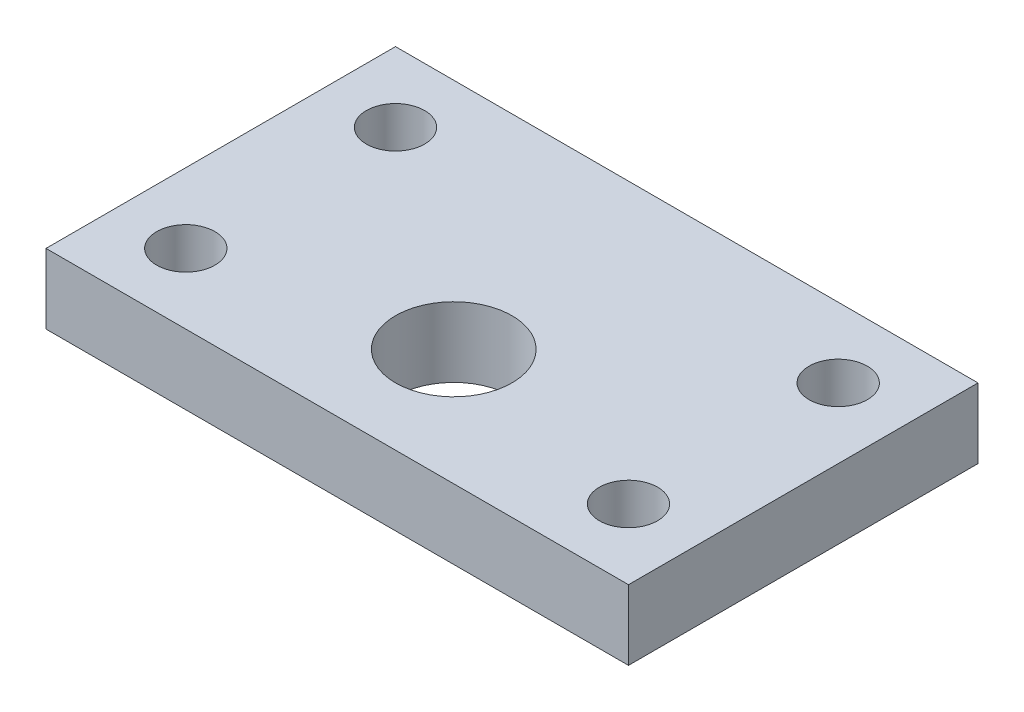
ISO-10303-21;
HEADER;
FILE_DESCRIPTION(('STEP AP214'),'2;1');
FILE_NAME('part.step','',(''),(''),'','','');
FILE_SCHEMA(('AUTOMOTIVE_DESIGN { 1 0 10303 214 1 1 1 1 }'));
ENDSEC;
DATA;
#1=APPLICATION_CONTEXT('core data for automotive mechanical design processes');
#2=APPLICATION_PROTOCOL_DEFINITION('international standard','automotive_design',2000,#1);
#3=PRODUCT_CONTEXT('',#1,'mechanical');
#4=PRODUCT('Part','Part','',(#3));
#5=PRODUCT_RELATED_PRODUCT_CATEGORY('part','',(#4));
#6=PRODUCT_DEFINITION_FORMATION('','',#4);
#7=PRODUCT_DEFINITION_CONTEXT('part definition',#1,'design');
#8=PRODUCT_DEFINITION('design','',#6,#7);
#9=PRODUCT_DEFINITION_SHAPE('','',#8);
#10=(LENGTH_UNIT() NAMED_UNIT(*) SI_UNIT(.MILLI.,.METRE.));
#11=(NAMED_UNIT(*) PLANE_ANGLE_UNIT() SI_UNIT($,.RADIAN.));
#12=(NAMED_UNIT(*) SI_UNIT($,.STERADIAN.) SOLID_ANGLE_UNIT());
#13=UNCERTAINTY_MEASURE_WITH_UNIT(LENGTH_MEASURE(1.E-05),#10,'distance_accuracy_value','');
#14=(GEOMETRIC_REPRESENTATION_CONTEXT(3) GLOBAL_UNCERTAINTY_ASSIGNED_CONTEXT((#13)) GLOBAL_UNIT_ASSIGNED_CONTEXT((#10,
#11,#12)) REPRESENTATION_CONTEXT('',''));
#15=CARTESIAN_POINT('',(0.,0.,0.));
#16=DIRECTION('',(0.,0.,1.));
#17=DIRECTION('',(1.,0.,0.));
#18=AXIS2_PLACEMENT_3D('',#15,#16,#17);
#19=CARTESIAN_POINT('',(0.,30.,0.));
#20=DIRECTION('',(0.,-1.,0.));
#21=DIRECTION('',(0.,0.,-1.));
#22=AXIS2_PLACEMENT_3D('',#19,#20,#21);
#23=PLANE('',#22);
#24=DIRECTION('',(0.,0.,1.));
#25=VECTOR('',#24,1.);
#26=CARTESIAN_POINT('',(0.,30.,0.));
#27=LINE('',#26,#25);
#28=CARTESIAN_POINT('',(0.,30.,-150.));
#29=VERTEX_POINT('',#28);
#30=CARTESIAN_POINT('',(0.,30.,0.));
#31=VERTEX_POINT('',#30);
#32=EDGE_CURVE('E89',#29,#31,#27,.T.);
#33=ORIENTED_EDGE('',*,*,#32,.T.);
#34=DIRECTION('',(1.,0.,0.));
#35=VECTOR('',#34,1.);
#36=CARTESIAN_POINT('',(0.,30.,0.));
#37=LINE('',#36,#35);
#38=CARTESIAN_POINT('',(250.,30.,0.));
#39=VERTEX_POINT('',#38);
#40=EDGE_CURVE('E84',#31,#39,#37,.T.);
#41=ORIENTED_EDGE('',*,*,#40,.T.);
#42=DIRECTION('',(0.,0.,-1.));
#43=VECTOR('',#42,1.);
#44=CARTESIAN_POINT('',(250.,30.,0.));
#45=LINE('',#44,#43);
#46=CARTESIAN_POINT('',(250.,30.,-150.));
#47=VERTEX_POINT('',#46);
#48=EDGE_CURVE('E87',#39,#47,#45,.T.);
#49=ORIENTED_EDGE('',*,*,#48,.T.);
#50=DIRECTION('',(-1.,0.,0.));
#51=VECTOR('',#50,1.);
#52=CARTESIAN_POINT('',(0.,30.,-150.));
#53=LINE('',#52,#51);
#54=EDGE_CURVE('E54',#47,#29,#53,.T.);
#55=ORIENTED_EDGE('',*,*,#54,.T.);
#56=EDGE_LOOP('',(#33,#41,#49,#55));
#57=FACE_BOUND('',#56,.T.);
#58=CARTESIAN_POINT('',(30.,30.,-30.));
#59=DIRECTION('',(0.,1.,0.));
#60=DIRECTION('',(0.,0.,1.));
#61=AXIS2_PLACEMENT_3D('',#58,#59,#60);
#62=CIRCLE('',#61,12.5);
#63=CARTESIAN_POINT('',(30.,30.,-17.5));
#64=VERTEX_POINT('',#63);
#65=EDGE_CURVE('E104',#64,#64,#62,.T.);
#66=ORIENTED_EDGE('',*,*,#65,.F.);
#67=EDGE_LOOP('',(#66));
#68=FACE_BOUND('',#67,.T.);
#69=CARTESIAN_POINT('',(30.,30.,-120.));
#70=DIRECTION('',(0.,1.,0.));
#71=DIRECTION('',(0.,0.,1.));
#72=AXIS2_PLACEMENT_3D('',#69,#70,#71);
#73=CIRCLE('',#72,12.5);
#74=CARTESIAN_POINT('',(30.,30.,-107.5));
#75=VERTEX_POINT('',#74);
#76=EDGE_CURVE('E119',#75,#75,#73,.T.);
#77=ORIENTED_EDGE('',*,*,#76,.F.);
#78=EDGE_LOOP('',(#77));
#79=FACE_BOUND('',#78,.T.);
#80=CARTESIAN_POINT('',(220.,30.,-120.));
#81=DIRECTION('',(0.,1.,0.));
#82=DIRECTION('',(0.,0.,-1.));
#83=AXIS2_PLACEMENT_3D('',#80,#81,#82);
#84=CIRCLE('',#83,12.5);
#85=CARTESIAN_POINT('',(220.,30.,-132.5));
#86=VERTEX_POINT('',#85);
#87=EDGE_CURVE('E125',#86,#86,#84,.T.);
#88=ORIENTED_EDGE('',*,*,#87,.F.);
#89=EDGE_LOOP('',(#88));
#90=FACE_BOUND('',#89,.T.);
#91=CARTESIAN_POINT('',(220.,30.,-30.));
#92=DIRECTION('',(0.,1.,0.));
#93=DIRECTION('',(0.,0.,-1.));
#94=AXIS2_PLACEMENT_3D('',#91,#92,#93);
#95=CIRCLE('',#94,12.5);
#96=CARTESIAN_POINT('',(220.,30.,-42.5));
#97=VERTEX_POINT('',#96);
#98=EDGE_CURVE('E131',#97,#97,#95,.T.);
#99=ORIENTED_EDGE('',*,*,#98,.F.);
#100=EDGE_LOOP('',(#99));
#101=FACE_BOUND('',#100,.T.);
#102=CARTESIAN_POINT('',(125.,30.,-50.));
#103=DIRECTION('',(0.,1.,0.));
#104=DIRECTION('',(0.,0.,1.));
#105=AXIS2_PLACEMENT_3D('',#102,#103,#104);
#106=CIRCLE('',#105,25.);
#107=CARTESIAN_POINT('',(125.,30.,-25.));
#108=VERTEX_POINT('',#107);
#109=EDGE_CURVE('E137',#108,#108,#106,.T.);
#110=ORIENTED_EDGE('',*,*,#109,.F.);
#111=EDGE_LOOP('',(#110));
#112=FACE_BOUND('',#111,.T.);
#113=ADVANCED_FACE('F37',(#57,#68,#79,#90,#101,#112),#23,.F.);
#114=CARTESIAN_POINT('',(0.,0.,0.));
#115=DIRECTION('',(0.,-1.,0.));
#116=DIRECTION('',(0.,0.,-1.));
#117=AXIS2_PLACEMENT_3D('',#114,#115,#116);
#118=PLANE('',#117);
#119=CARTESIAN_POINT('',(220.,0.,-30.));
#120=DIRECTION('',(0.,1.,0.));
#121=DIRECTION('',(0.,0.,-1.));
#122=AXIS2_PLACEMENT_3D('',#119,#120,#121);
#123=CIRCLE('',#122,12.5);
#124=CARTESIAN_POINT('',(220.,0.,-42.5));
#125=VERTEX_POINT('',#124);
#126=EDGE_CURVE('E134',#125,#125,#123,.T.);
#127=ORIENTED_EDGE('',*,*,#126,.T.);
#128=EDGE_LOOP('',(#127));
#129=FACE_BOUND('',#128,.T.);
#130=CARTESIAN_POINT('',(30.,0.,-120.));
#131=DIRECTION('',(0.,1.,0.));
#132=DIRECTION('',(0.,0.,1.));
#133=AXIS2_PLACEMENT_3D('',#130,#131,#132);
#134=CIRCLE('',#133,12.5);
#135=CARTESIAN_POINT('',(30.,0.,-107.5));
#136=VERTEX_POINT('',#135);
#137=EDGE_CURVE('E122',#136,#136,#134,.T.);
#138=ORIENTED_EDGE('',*,*,#137,.T.);
#139=EDGE_LOOP('',(#138));
#140=FACE_BOUND('',#139,.T.);
#141=DIRECTION('',(0.,0.,1.));
#142=VECTOR('',#141,1.);
#143=CARTESIAN_POINT('',(0.,0.,0.));
#144=LINE('',#143,#142);
#145=CARTESIAN_POINT('',(0.,0.,-150.));
#146=VERTEX_POINT('',#145);
#147=CARTESIAN_POINT('',(0.,0.,0.));
#148=VERTEX_POINT('',#147);
#149=EDGE_CURVE('E101',#146,#148,#144,.T.);
#150=ORIENTED_EDGE('',*,*,#149,.F.);
#151=DIRECTION('',(-1.,0.,0.));
#152=VECTOR('',#151,1.);
#153=CARTESIAN_POINT('',(0.,0.,-150.));
#154=LINE('',#153,#152);
#155=CARTESIAN_POINT('',(250.,0.,-150.));
#156=VERTEX_POINT('',#155);
#157=EDGE_CURVE('E77',#156,#146,#154,.T.);
#158=ORIENTED_EDGE('',*,*,#157,.F.);
#159=DIRECTION('',(0.,0.,-1.));
#160=VECTOR('',#159,1.);
#161=CARTESIAN_POINT('',(250.,0.,0.));
#162=LINE('',#161,#160);
#163=CARTESIAN_POINT('',(250.,0.,0.));
#164=VERTEX_POINT('',#163);
#165=EDGE_CURVE('E71',#164,#156,#162,.T.);
#166=ORIENTED_EDGE('',*,*,#165,.F.);
#167=DIRECTION('',(1.,0.,0.));
#168=VECTOR('',#167,1.);
#169=CARTESIAN_POINT('',(0.,0.,0.));
#170=LINE('',#169,#168);
#171=EDGE_CURVE('E93',#148,#164,#170,.T.);
#172=ORIENTED_EDGE('',*,*,#171,.F.);
#173=EDGE_LOOP('',(#150,#158,#166,#172));
#174=FACE_BOUND('',#173,.T.);
#175=CARTESIAN_POINT('',(30.,0.,-30.));
#176=DIRECTION('',(0.,1.,0.));
#177=DIRECTION('',(0.,0.,1.));
#178=AXIS2_PLACEMENT_3D('',#175,#176,#177);
#179=CIRCLE('',#178,12.5);
#180=CARTESIAN_POINT('',(30.,0.,-17.5));
#181=VERTEX_POINT('',#180);
#182=EDGE_CURVE('E116',#181,#181,#179,.T.);
#183=ORIENTED_EDGE('',*,*,#182,.T.);
#184=EDGE_LOOP('',(#183));
#185=FACE_BOUND('',#184,.T.);
#186=CARTESIAN_POINT('',(220.,0.,-120.));
#187=DIRECTION('',(0.,1.,0.));
#188=DIRECTION('',(0.,0.,-1.));
#189=AXIS2_PLACEMENT_3D('',#186,#187,#188);
#190=CIRCLE('',#189,12.5);
#191=CARTESIAN_POINT('',(220.,0.,-132.5));
#192=VERTEX_POINT('',#191);
#193=EDGE_CURVE('E128',#192,#192,#190,.T.);
#194=ORIENTED_EDGE('',*,*,#193,.T.);
#195=EDGE_LOOP('',(#194));
#196=FACE_BOUND('',#195,.T.);
#197=CARTESIAN_POINT('',(125.,0.,-50.));
#198=DIRECTION('',(0.,1.,0.));
#199=DIRECTION('',(0.,0.,1.));
#200=AXIS2_PLACEMENT_3D('',#197,#198,#199);
#201=CIRCLE('',#200,25.);
#202=CARTESIAN_POINT('',(125.,0.,-25.));
#203=VERTEX_POINT('',#202);
#204=EDGE_CURVE('E140',#203,#203,#201,.T.);
#205=ORIENTED_EDGE('',*,*,#204,.T.);
#206=EDGE_LOOP('',(#205));
#207=FACE_BOUND('',#206,.T.);
#208=ADVANCED_FACE('F112',(#129,#140,#174,#185,#196,#207),#118,.T.);
#209=CARTESIAN_POINT('',(0.,30.,0.));
#210=DIRECTION('',(1.,0.,0.));
#211=DIRECTION('',(0.,0.,-1.));
#212=AXIS2_PLACEMENT_3D('',#209,#210,#211);
#213=PLANE('',#212);
#214=ORIENTED_EDGE('',*,*,#149,.T.);
#215=DIRECTION('',(0.,-1.,0.));
#216=VECTOR('',#215,1.);
#217=CARTESIAN_POINT('',(0.,30.,0.));
#218=LINE('',#217,#216);
#219=EDGE_CURVE('E11',#31,#148,#218,.T.);
#220=ORIENTED_EDGE('',*,*,#219,.F.);
#221=ORIENTED_EDGE('',*,*,#32,.F.);
#222=DIRECTION('',(0.,-1.,0.));
#223=VECTOR('',#222,1.);
#224=CARTESIAN_POINT('',(0.,30.,-150.));
#225=LINE('',#224,#223);
#226=EDGE_CURVE('E97',#29,#146,#225,.T.);
#227=ORIENTED_EDGE('',*,*,#226,.T.);
#228=EDGE_LOOP('',(#214,#220,#221,#227));
#229=FACE_BOUND('',#228,.T.);
#230=ADVANCED_FACE('F39',(#229),#213,.F.);
#231=CARTESIAN_POINT('',(0.,30.,0.));
#232=DIRECTION('',(0.,0.,-1.));
#233=DIRECTION('',(-1.,0.,0.));
#234=AXIS2_PLACEMENT_3D('',#231,#232,#233);
#235=PLANE('',#234);
#236=ORIENTED_EDGE('',*,*,#171,.T.);
#237=DIRECTION('',(0.,-1.,0.));
#238=VECTOR('',#237,1.);
#239=CARTESIAN_POINT('',(250.,30.,0.));
#240=LINE('',#239,#238);
#241=EDGE_CURVE('E46',#39,#164,#240,.T.);
#242=ORIENTED_EDGE('',*,*,#241,.F.);
#243=ORIENTED_EDGE('',*,*,#40,.F.);
#244=ORIENTED_EDGE('',*,*,#219,.T.);
#245=EDGE_LOOP('',(#236,#242,#243,#244));
#246=FACE_BOUND('',#245,.T.);
#247=ADVANCED_FACE('F92',(#246),#235,.F.);
#248=CARTESIAN_POINT('',(250.,30.,0.));
#249=DIRECTION('',(-1.,0.,0.));
#250=DIRECTION('',(0.,0.,1.));
#251=AXIS2_PLACEMENT_3D('',#248,#249,#250);
#252=PLANE('',#251);
#253=ORIENTED_EDGE('',*,*,#165,.T.);
#254=DIRECTION('',(0.,-1.,0.));
#255=VECTOR('',#254,1.);
#256=CARTESIAN_POINT('',(250.,30.,-150.));
#257=LINE('',#256,#255);
#258=EDGE_CURVE('E94',#47,#156,#257,.T.);
#259=ORIENTED_EDGE('',*,*,#258,.F.);
#260=ORIENTED_EDGE('',*,*,#48,.F.);
#261=ORIENTED_EDGE('',*,*,#241,.T.);
#262=EDGE_LOOP('',(#253,#259,#260,#261));
#263=FACE_BOUND('',#262,.T.);
#264=ADVANCED_FACE('F95',(#263),#252,.F.);
#265=CARTESIAN_POINT('',(0.,30.,-150.));
#266=DIRECTION('',(0.,0.,1.));
#267=DIRECTION('',(1.,0.,0.));
#268=AXIS2_PLACEMENT_3D('',#265,#266,#267);
#269=PLANE('',#268);
#270=ORIENTED_EDGE('',*,*,#157,.T.);
#271=ORIENTED_EDGE('',*,*,#226,.F.);
#272=ORIENTED_EDGE('',*,*,#54,.F.);
#273=ORIENTED_EDGE('',*,*,#258,.T.);
#274=EDGE_LOOP('',(#270,#271,#272,#273));
#275=FACE_BOUND('',#274,.T.);
#276=ADVANCED_FACE('F109',(#275),#269,.F.);
#277=CARTESIAN_POINT('',(30.,30.,-30.));
#278=DIRECTION('',(0.,-1.,0.));
#279=DIRECTION('',(0.,0.,-1.));
#280=AXIS2_PLACEMENT_3D('',#277,#278,#279);
#281=CYLINDRICAL_SURFACE('',#280,12.5);
#282=ORIENTED_EDGE('',*,*,#65,.T.);
#283=EDGE_LOOP('',(#282));
#284=FACE_BOUND('',#283,.T.);
#285=ORIENTED_EDGE('',*,*,#182,.F.);
#286=EDGE_LOOP('',(#285));
#287=FACE_BOUND('',#286,.T.);
#288=ADVANCED_FACE('F157',(#284,#287),#281,.F.);
#289=CARTESIAN_POINT('',(30.,30.,-120.));
#290=DIRECTION('',(0.,-1.,0.));
#291=DIRECTION('',(0.,0.,-1.));
#292=AXIS2_PLACEMENT_3D('',#289,#290,#291);
#293=CYLINDRICAL_SURFACE('',#292,12.5);
#294=ORIENTED_EDGE('',*,*,#76,.T.);
#295=EDGE_LOOP('',(#294));
#296=FACE_BOUND('',#295,.T.);
#297=ORIENTED_EDGE('',*,*,#137,.F.);
#298=EDGE_LOOP('',(#297));
#299=FACE_BOUND('',#298,.T.);
#300=ADVANCED_FACE('F211',(#296,#299),#293,.F.);
#301=CARTESIAN_POINT('',(220.,30.,-120.));
#302=DIRECTION('',(0.,-1.,0.));
#303=DIRECTION('',(0.,0.,-1.));
#304=AXIS2_PLACEMENT_3D('',#301,#302,#303);
#305=CYLINDRICAL_SURFACE('',#304,12.5);
#306=ORIENTED_EDGE('',*,*,#87,.T.);
#307=EDGE_LOOP('',(#306));
#308=FACE_BOUND('',#307,.T.);
#309=ORIENTED_EDGE('',*,*,#193,.F.);
#310=EDGE_LOOP('',(#309));
#311=FACE_BOUND('',#310,.T.);
#312=ADVANCED_FACE('F220',(#308,#311),#305,.F.);
#313=CARTESIAN_POINT('',(220.,30.,-30.));
#314=DIRECTION('',(0.,-1.,0.));
#315=DIRECTION('',(0.,0.,-1.));
#316=AXIS2_PLACEMENT_3D('',#313,#314,#315);
#317=CYLINDRICAL_SURFACE('',#316,12.5);
#318=ORIENTED_EDGE('',*,*,#98,.T.);
#319=EDGE_LOOP('',(#318));
#320=FACE_BOUND('',#319,.T.);
#321=ORIENTED_EDGE('',*,*,#126,.F.);
#322=EDGE_LOOP('',(#321));
#323=FACE_BOUND('',#322,.T.);
#324=ADVANCED_FACE('F229',(#320,#323),#317,.F.);
#325=CARTESIAN_POINT('',(125.,30.,-50.));
#326=DIRECTION('',(0.,-1.,0.));
#327=DIRECTION('',(0.,0.,-1.));
#328=AXIS2_PLACEMENT_3D('',#325,#326,#327);
#329=CYLINDRICAL_SURFACE('',#328,25.);
#330=ORIENTED_EDGE('',*,*,#109,.T.);
#331=EDGE_LOOP('',(#330));
#332=FACE_BOUND('',#331,.T.);
#333=ORIENTED_EDGE('',*,*,#204,.F.);
#334=EDGE_LOOP('',(#333));
#335=FACE_BOUND('',#334,.T.);
#336=ADVANCED_FACE('F146',(#332,#335),#329,.F.);
#337=CLOSED_SHELL('',(#113,#208,#230,#247,#264,#276,#288,#300,#312,#324,#336));
#338=MANIFOLD_SOLID_BREP('B2',#337);
#339=ADVANCED_BREP_SHAPE_REPRESENTATION('',(#18,#338),#14);
#340=SHAPE_DEFINITION_REPRESENTATION(#9,#339);
ENDSEC;
END-ISO-10303-21;
